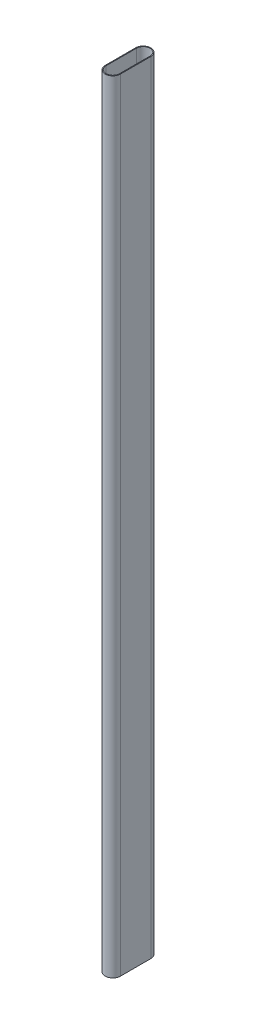
ISO-10303-21;
HEADER;
FILE_DESCRIPTION(('STEP AP214'),'2;1');
FILE_NAME('part.step','',(''),(''),'','','');
FILE_SCHEMA(('AUTOMOTIVE_DESIGN { 1 0 10303 214 1 1 1 1 }'));
ENDSEC;
DATA;
#1=APPLICATION_CONTEXT('core data for automotive mechanical design processes');
#2=APPLICATION_PROTOCOL_DEFINITION('international standard','automotive_design',2000,#1);
#3=PRODUCT_CONTEXT('',#1,'mechanical');
#4=PRODUCT('Part','Part','',(#3));
#5=PRODUCT_RELATED_PRODUCT_CATEGORY('part','',(#4));
#6=PRODUCT_DEFINITION_FORMATION('','',#4);
#7=PRODUCT_DEFINITION_CONTEXT('part definition',#1,'design');
#8=PRODUCT_DEFINITION('design','',#6,#7);
#9=PRODUCT_DEFINITION_SHAPE('','',#8);
#10=(LENGTH_UNIT() NAMED_UNIT(*) SI_UNIT(.MILLI.,.METRE.));
#11=(NAMED_UNIT(*) PLANE_ANGLE_UNIT() SI_UNIT($,.RADIAN.));
#12=(NAMED_UNIT(*) SI_UNIT($,.STERADIAN.) SOLID_ANGLE_UNIT());
#13=UNCERTAINTY_MEASURE_WITH_UNIT(LENGTH_MEASURE(1.E-05),#10,'distance_accuracy_value','');
#14=(GEOMETRIC_REPRESENTATION_CONTEXT(3) GLOBAL_UNCERTAINTY_ASSIGNED_CONTEXT((#13)) GLOBAL_UNIT_ASSIGNED_CONTEXT((#10,
#11,#12)) REPRESENTATION_CONTEXT('',''));
#15=CARTESIAN_POINT('',(0.,0.,0.));
#16=DIRECTION('',(0.,0.,1.));
#17=DIRECTION('',(1.,0.,0.));
#18=AXIS2_PLACEMENT_3D('',#15,#16,#17);
#19=CARTESIAN_POINT('',(0.,515.,10.));
#20=DIRECTION('',(0.,1.,0.));
#21=DIRECTION('',(0.,0.,1.));
#22=AXIS2_PLACEMENT_3D('',#19,#20,#21);
#23=PLANE('',#22);
#24=CARTESIAN_POINT('',(0.,515.,10.));
#25=DIRECTION('',(0.,1.,0.));
#26=DIRECTION('',(0.,0.,1.));
#27=AXIS2_PLACEMENT_3D('',#24,#25,#26);
#28=CIRCLE('',#27,5.);
#29=CARTESIAN_POINT('',(-5.,515.,10.));
#30=VERTEX_POINT('',#29);
#31=CARTESIAN_POINT('',(5.,515.,10.));
#32=VERTEX_POINT('',#31);
#33=EDGE_CURVE('E158',#30,#32,#28,.T.);
#34=ORIENTED_EDGE('',*,*,#33,.T.);
#35=DIRECTION('',(0.,0.,-1.));
#36=VECTOR('',#35,1.);
#37=CARTESIAN_POINT('',(5.,515.,10.));
#38=LINE('',#37,#36);
#39=CARTESIAN_POINT('',(5.,515.,-10.));
#40=VERTEX_POINT('',#39);
#41=EDGE_CURVE('E161',#32,#40,#38,.T.);
#42=ORIENTED_EDGE('',*,*,#41,.T.);
#43=CARTESIAN_POINT('',(0.,515.,-10.));
#44=DIRECTION('',(0.,1.,0.));
#45=DIRECTION('',(0.,0.,1.));
#46=AXIS2_PLACEMENT_3D('',#43,#44,#45);
#47=CIRCLE('',#46,5.);
#48=CARTESIAN_POINT('',(-5.00000000000001,515.,-10.));
#49=VERTEX_POINT('',#48);
#50=EDGE_CURVE('E164',#40,#49,#47,.T.);
#51=ORIENTED_EDGE('',*,*,#50,.T.);
#52=DIRECTION('',(0.,0.,1.));
#53=VECTOR('',#52,1.);
#54=CARTESIAN_POINT('',(-5.,515.,10.));
#55=LINE('',#54,#53);
#56=EDGE_CURVE('E166',#49,#30,#55,.T.);
#57=ORIENTED_EDGE('',*,*,#56,.T.);
#58=EDGE_LOOP('',(#34,#42,#51,#57));
#59=FACE_BOUND('',#58,.T.);
#60=DIRECTION('',(0.,0.,-1.));
#61=VECTOR('',#60,1.);
#62=CARTESIAN_POINT('',(4.5,515.,10.));
#63=LINE('',#62,#61);
#64=CARTESIAN_POINT('',(4.5,515.,10.));
#65=VERTEX_POINT('',#64);
#66=CARTESIAN_POINT('',(4.5,515.,-10.));
#67=VERTEX_POINT('',#66);
#68=EDGE_CURVE('E130',#65,#67,#63,.T.);
#69=ORIENTED_EDGE('',*,*,#68,.F.);
#70=CARTESIAN_POINT('',(0.,515.,10.));
#71=DIRECTION('',(0.,1.,0.));
#72=DIRECTION('',(1.,0.,0.));
#73=AXIS2_PLACEMENT_3D('',#70,#71,#72);
#74=CIRCLE('',#73,4.5);
#75=CARTESIAN_POINT('',(-4.5,515.,10.));
#76=VERTEX_POINT('',#75);
#77=EDGE_CURVE('E122',#76,#65,#74,.T.);
#78=ORIENTED_EDGE('',*,*,#77,.F.);
#79=DIRECTION('',(0.,0.,1.));
#80=VECTOR('',#79,1.);
#81=CARTESIAN_POINT('',(-4.5,515.,10.));
#82=LINE('',#81,#80);
#83=CARTESIAN_POINT('',(-4.50000000000001,515.,-9.99999999999999));
#84=VERTEX_POINT('',#83);
#85=EDGE_CURVE('E144',#84,#76,#82,.T.);
#86=ORIENTED_EDGE('',*,*,#85,.F.);
#87=CARTESIAN_POINT('',(0.,515.,-10.));
#88=DIRECTION('',(0.,1.,0.));
#89=DIRECTION('',(1.,0.,0.));
#90=AXIS2_PLACEMENT_3D('',#87,#88,#89);
#91=CIRCLE('',#90,4.5);
#92=EDGE_CURVE('E142',#67,#84,#91,.T.);
#93=ORIENTED_EDGE('',*,*,#92,.F.);
#94=EDGE_LOOP('',(#69,#78,#86,#93));
#95=FACE_BOUND('',#94,.T.);
#96=ADVANCED_FACE('F57',(#59,#95),#23,.T.);
#97=CARTESIAN_POINT('',(0.,0.,10.));
#98=DIRECTION('',(0.,1.,0.));
#99=DIRECTION('',(0.,0.,1.));
#100=AXIS2_PLACEMENT_3D('',#97,#98,#99);
#101=PLANE('',#100);
#102=CARTESIAN_POINT('',(0.,0.,10.));
#103=DIRECTION('',(0.,1.,0.));
#104=DIRECTION('',(0.,0.,1.));
#105=AXIS2_PLACEMENT_3D('',#102,#103,#104);
#106=CIRCLE('',#105,5.);
#107=CARTESIAN_POINT('',(-5.,0.,10.));
#108=VERTEX_POINT('',#107);
#109=CARTESIAN_POINT('',(5.,0.,10.));
#110=VERTEX_POINT('',#109);
#111=EDGE_CURVE('E138',#108,#110,#106,.T.);
#112=ORIENTED_EDGE('',*,*,#111,.F.);
#113=DIRECTION('',(0.,0.,1.));
#114=VECTOR('',#113,1.);
#115=CARTESIAN_POINT('',(-5.,0.,10.));
#116=LINE('',#115,#114);
#117=CARTESIAN_POINT('',(-5.00000000000001,0.,-10.));
#118=VERTEX_POINT('',#117);
#119=EDGE_CURVE('E162',#118,#108,#116,.T.);
#120=ORIENTED_EDGE('',*,*,#119,.F.);
#121=CARTESIAN_POINT('',(0.,0.,-10.));
#122=DIRECTION('',(0.,1.,0.));
#123=DIRECTION('',(0.,0.,1.));
#124=AXIS2_PLACEMENT_3D('',#121,#122,#123);
#125=CIRCLE('',#124,5.);
#126=CARTESIAN_POINT('',(5.,0.,-10.));
#127=VERTEX_POINT('',#126);
#128=EDGE_CURVE('E173',#127,#118,#125,.T.);
#129=ORIENTED_EDGE('',*,*,#128,.F.);
#130=DIRECTION('',(0.,0.,-1.));
#131=VECTOR('',#130,1.);
#132=CARTESIAN_POINT('',(5.,0.,10.));
#133=LINE('',#132,#131);
#134=EDGE_CURVE('E171',#110,#127,#133,.T.);
#135=ORIENTED_EDGE('',*,*,#134,.F.);
#136=EDGE_LOOP('',(#112,#120,#129,#135));
#137=FACE_BOUND('',#136,.T.);
#138=CARTESIAN_POINT('',(0.,0.,10.));
#139=DIRECTION('',(0.,1.,0.));
#140=DIRECTION('',(1.,0.,0.));
#141=AXIS2_PLACEMENT_3D('',#138,#139,#140);
#142=CIRCLE('',#141,4.5);
#143=CARTESIAN_POINT('',(-4.5,0.,10.));
#144=VERTEX_POINT('',#143);
#145=CARTESIAN_POINT('',(4.5,0.,10.));
#146=VERTEX_POINT('',#145);
#147=EDGE_CURVE('E80',#144,#146,#142,.T.);
#148=ORIENTED_EDGE('',*,*,#147,.T.);
#149=DIRECTION('',(0.,0.,-1.));
#150=VECTOR('',#149,1.);
#151=CARTESIAN_POINT('',(4.5,0.,10.));
#152=LINE('',#151,#150);
#153=CARTESIAN_POINT('',(4.5,0.,-10.));
#154=VERTEX_POINT('',#153);
#155=EDGE_CURVE('E137',#146,#154,#152,.T.);
#156=ORIENTED_EDGE('',*,*,#155,.T.);
#157=CARTESIAN_POINT('',(0.,0.,-10.));
#158=DIRECTION('',(0.,1.,0.));
#159=DIRECTION('',(1.,0.,0.));
#160=AXIS2_PLACEMENT_3D('',#157,#158,#159);
#161=CIRCLE('',#160,4.5);
#162=CARTESIAN_POINT('',(-4.50000000000001,0.,-9.99999999999999));
#163=VERTEX_POINT('',#162);
#164=EDGE_CURVE('E150',#154,#163,#161,.T.);
#165=ORIENTED_EDGE('',*,*,#164,.T.);
#166=DIRECTION('',(0.,0.,1.));
#167=VECTOR('',#166,1.);
#168=CARTESIAN_POINT('',(-4.5,0.,10.));
#169=LINE('',#168,#167);
#170=EDGE_CURVE('E131',#163,#144,#169,.T.);
#171=ORIENTED_EDGE('',*,*,#170,.T.);
#172=EDGE_LOOP('',(#148,#156,#165,#171));
#173=FACE_BOUND('',#172,.T.);
#174=ADVANCED_FACE('F191',(#137,#173),#101,.F.);
#175=CARTESIAN_POINT('',(0.,515.,10.));
#176=DIRECTION('',(0.,-1.,0.));
#177=DIRECTION('',(0.,0.,-1.));
#178=AXIS2_PLACEMENT_3D('',#175,#176,#177);
#179=CYLINDRICAL_SURFACE('',#178,5.);
#180=ORIENTED_EDGE('',*,*,#111,.T.);
#181=DIRECTION('',(0.,-1.,0.));
#182=VECTOR('',#181,1.);
#183=CARTESIAN_POINT('',(5.,515.,10.));
#184=LINE('',#183,#182);
#185=EDGE_CURVE('E12',#32,#110,#184,.T.);
#186=ORIENTED_EDGE('',*,*,#185,.F.);
#187=ORIENTED_EDGE('',*,*,#33,.F.);
#188=DIRECTION('',(0.,-1.,0.));
#189=VECTOR('',#188,1.);
#190=CARTESIAN_POINT('',(-5.,515.,10.));
#191=LINE('',#190,#189);
#192=EDGE_CURVE('E168',#30,#108,#191,.T.);
#193=ORIENTED_EDGE('',*,*,#192,.T.);
#194=EDGE_LOOP('',(#180,#186,#187,#193));
#195=FACE_BOUND('',#194,.T.);
#196=ADVANCED_FACE('F59',(#195),#179,.T.);
#197=CARTESIAN_POINT('',(5.,515.,10.));
#198=DIRECTION('',(-1.,0.,0.));
#199=DIRECTION('',(0.,0.,1.));
#200=AXIS2_PLACEMENT_3D('',#197,#198,#199);
#201=PLANE('',#200);
#202=ORIENTED_EDGE('',*,*,#134,.T.);
#203=DIRECTION('',(0.,-1.,0.));
#204=VECTOR('',#203,1.);
#205=CARTESIAN_POINT('',(5.,515.,-10.));
#206=LINE('',#205,#204);
#207=EDGE_CURVE('E65',#40,#127,#206,.T.);
#208=ORIENTED_EDGE('',*,*,#207,.F.);
#209=ORIENTED_EDGE('',*,*,#41,.F.);
#210=ORIENTED_EDGE('',*,*,#185,.T.);
#211=EDGE_LOOP('',(#202,#208,#209,#210));
#212=FACE_BOUND('',#211,.T.);
#213=ADVANCED_FACE('F201',(#212),#201,.F.);
#214=CARTESIAN_POINT('',(0.,515.,-10.));
#215=DIRECTION('',(0.,-1.,0.));
#216=DIRECTION('',(0.,0.,-1.));
#217=AXIS2_PLACEMENT_3D('',#214,#215,#216);
#218=CYLINDRICAL_SURFACE('',#217,5.);
#219=ORIENTED_EDGE('',*,*,#128,.T.);
#220=DIRECTION('',(0.,-1.,0.));
#221=VECTOR('',#220,1.);
#222=CARTESIAN_POINT('',(-5.00000000000001,515.,-10.));
#223=LINE('',#222,#221);
#224=EDGE_CURVE('E178',#49,#118,#223,.T.);
#225=ORIENTED_EDGE('',*,*,#224,.F.);
#226=ORIENTED_EDGE('',*,*,#50,.F.);
#227=ORIENTED_EDGE('',*,*,#207,.T.);
#228=EDGE_LOOP('',(#219,#225,#226,#227));
#229=FACE_BOUND('',#228,.T.);
#230=ADVANCED_FACE('F185',(#229),#218,.T.);
#231=CARTESIAN_POINT('',(-5.,515.,10.));
#232=DIRECTION('',(1.,0.,0.));
#233=DIRECTION('',(0.,0.,-1.));
#234=AXIS2_PLACEMENT_3D('',#231,#232,#233);
#235=PLANE('',#234);
#236=ORIENTED_EDGE('',*,*,#119,.T.);
#237=ORIENTED_EDGE('',*,*,#192,.F.);
#238=ORIENTED_EDGE('',*,*,#56,.F.);
#239=ORIENTED_EDGE('',*,*,#224,.T.);
#240=EDGE_LOOP('',(#236,#237,#238,#239));
#241=FACE_BOUND('',#240,.T.);
#242=ADVANCED_FACE('F195',(#241),#235,.F.);
#243=CARTESIAN_POINT('',(0.,515.,10.));
#244=DIRECTION('',(0.,-1.,0.));
#245=DIRECTION('',(0.,0.,-1.));
#246=AXIS2_PLACEMENT_3D('',#243,#244,#245);
#247=CYLINDRICAL_SURFACE('',#246,4.5);
#248=ORIENTED_EDGE('',*,*,#147,.F.);
#249=DIRECTION('',(0.,-1.,0.));
#250=VECTOR('',#249,1.);
#251=CARTESIAN_POINT('',(-4.5,515.,10.));
#252=LINE('',#251,#250);
#253=EDGE_CURVE('E126',#76,#144,#252,.T.);
#254=ORIENTED_EDGE('',*,*,#253,.F.);
#255=ORIENTED_EDGE('',*,*,#77,.T.);
#256=DIRECTION('',(0.,-1.,0.));
#257=VECTOR('',#256,1.);
#258=CARTESIAN_POINT('',(4.5,515.,10.));
#259=LINE('',#258,#257);
#260=EDGE_CURVE('E125',#65,#146,#259,.T.);
#261=ORIENTED_EDGE('',*,*,#260,.T.);
#262=EDGE_LOOP('',(#248,#254,#255,#261));
#263=FACE_BOUND('',#262,.T.);
#264=ADVANCED_FACE('F124',(#263),#247,.F.);
#265=CARTESIAN_POINT('',(4.5,515.,10.));
#266=DIRECTION('',(-1.,0.,0.));
#267=DIRECTION('',(0.,0.,1.));
#268=AXIS2_PLACEMENT_3D('',#265,#266,#267);
#269=PLANE('',#268);
#270=ORIENTED_EDGE('',*,*,#155,.F.);
#271=ORIENTED_EDGE('',*,*,#260,.F.);
#272=ORIENTED_EDGE('',*,*,#68,.T.);
#273=DIRECTION('',(0.,-1.,0.));
#274=VECTOR('',#273,1.);
#275=CARTESIAN_POINT('',(4.5,515.,-10.));
#276=LINE('',#275,#274);
#277=EDGE_CURVE('E139',#67,#154,#276,.T.);
#278=ORIENTED_EDGE('',*,*,#277,.T.);
#279=EDGE_LOOP('',(#270,#271,#272,#278));
#280=FACE_BOUND('',#279,.T.);
#281=ADVANCED_FACE('F134',(#280),#269,.T.);
#282=CARTESIAN_POINT('',(0.,515.,-10.));
#283=DIRECTION('',(0.,-1.,0.));
#284=DIRECTION('',(0.,0.,-1.));
#285=AXIS2_PLACEMENT_3D('',#282,#283,#284);
#286=CYLINDRICAL_SURFACE('',#285,4.5);
#287=ORIENTED_EDGE('',*,*,#164,.F.);
#288=ORIENTED_EDGE('',*,*,#277,.F.);
#289=ORIENTED_EDGE('',*,*,#92,.T.);
#290=DIRECTION('',(0.,-1.,0.));
#291=VECTOR('',#290,1.);
#292=CARTESIAN_POINT('',(-4.50000000000001,515.,-9.99999999999999));
#293=LINE('',#292,#291);
#294=EDGE_CURVE('E72',#84,#163,#293,.T.);
#295=ORIENTED_EDGE('',*,*,#294,.T.);
#296=EDGE_LOOP('',(#287,#288,#289,#295));
#297=FACE_BOUND('',#296,.T.);
#298=ADVANCED_FACE('F224',(#297),#286,.F.);
#299=CARTESIAN_POINT('',(-4.5,515.,10.));
#300=DIRECTION('',(1.,0.,0.));
#301=DIRECTION('',(0.,0.,-1.));
#302=AXIS2_PLACEMENT_3D('',#299,#300,#301);
#303=PLANE('',#302);
#304=ORIENTED_EDGE('',*,*,#170,.F.);
#305=ORIENTED_EDGE('',*,*,#294,.F.);
#306=ORIENTED_EDGE('',*,*,#85,.T.);
#307=ORIENTED_EDGE('',*,*,#253,.T.);
#308=EDGE_LOOP('',(#304,#305,#306,#307));
#309=FACE_BOUND('',#308,.T.);
#310=ADVANCED_FACE('F228',(#309),#303,.T.);
#311=CLOSED_SHELL('',(#96,#174,#196,#213,#230,#242,#264,#281,#298,#310));
#312=MANIFOLD_SOLID_BREP('B2',#311);
#313=ADVANCED_BREP_SHAPE_REPRESENTATION('',(#18,#312),#14);
#314=SHAPE_DEFINITION_REPRESENTATION(#9,#313);
ENDSEC;
END-ISO-10303-21;
